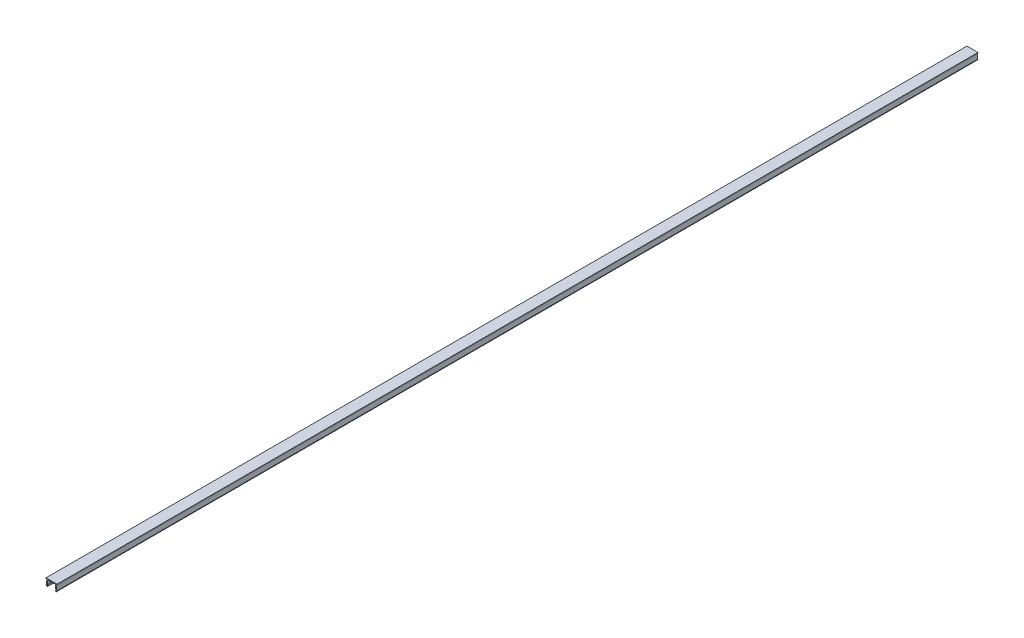
ISO-10303-21;
HEADER;
FILE_DESCRIPTION(('STEP AP214'),'2;1');
FILE_NAME('part.step','',(''),(''),'','','');
FILE_SCHEMA(('AUTOMOTIVE_DESIGN { 1 0 10303 214 1 1 1 1 }'));
ENDSEC;
DATA;
#1=APPLICATION_CONTEXT('core data for automotive mechanical design processes');
#2=APPLICATION_PROTOCOL_DEFINITION('international standard','automotive_design',2000,#1);
#3=PRODUCT_CONTEXT('',#1,'mechanical');
#4=PRODUCT('Part','Part','',(#3));
#5=PRODUCT_RELATED_PRODUCT_CATEGORY('part','',(#4));
#6=PRODUCT_DEFINITION_FORMATION('','',#4);
#7=PRODUCT_DEFINITION_CONTEXT('part definition',#1,'design');
#8=PRODUCT_DEFINITION('design','',#6,#7);
#9=PRODUCT_DEFINITION_SHAPE('','',#8);
#10=(LENGTH_UNIT() NAMED_UNIT(*) SI_UNIT(.MILLI.,.METRE.));
#11=(NAMED_UNIT(*) PLANE_ANGLE_UNIT() SI_UNIT($,.RADIAN.));
#12=(NAMED_UNIT(*) SI_UNIT($,.STERADIAN.) SOLID_ANGLE_UNIT());
#13=UNCERTAINTY_MEASURE_WITH_UNIT(LENGTH_MEASURE(1.E-05),#10,'distance_accuracy_value','');
#14=(GEOMETRIC_REPRESENTATION_CONTEXT(3) GLOBAL_UNCERTAINTY_ASSIGNED_CONTEXT((#13)) GLOBAL_UNIT_ASSIGNED_CONTEXT((#10,
#11,#12)) REPRESENTATION_CONTEXT('',''));
#15=CARTESIAN_POINT('',(0.,0.,0.));
#16=DIRECTION('',(0.,0.,1.));
#17=DIRECTION('',(1.,0.,0.));
#18=AXIS2_PLACEMENT_3D('',#15,#16,#17);
#19=CARTESIAN_POINT('',(-6.,0.5,500.));
#20=DIRECTION('',(1.,0.,0.));
#21=DIRECTION('',(0.,0.,-1.));
#22=AXIS2_PLACEMENT_3D('',#19,#20,#21);
#23=PLANE('',#22);
#24=DIRECTION('',(0.,-1.,0.));
#25=VECTOR('',#24,1.);
#26=CARTESIAN_POINT('',(-6.,0.5,-500.));
#27=LINE('',#26,#25);
#28=CARTESIAN_POINT('',(-6.,0.5,-500.));
#29=VERTEX_POINT('',#28);
#30=CARTESIAN_POINT('',(-6.,-0.5,-500.));
#31=VERTEX_POINT('',#30);
#32=EDGE_CURVE('E160',#29,#31,#27,.T.);
#33=ORIENTED_EDGE('',*,*,#32,.T.);
#34=DIRECTION('',(0.,0.,-1.));
#35=VECTOR('',#34,1.);
#36=CARTESIAN_POINT('',(-6.,-0.5,500.));
#37=LINE('',#36,#35);
#38=CARTESIAN_POINT('',(-6.,-0.5,500.));
#39=VERTEX_POINT('',#38);
#40=EDGE_CURVE('E10',#39,#31,#37,.T.);
#41=ORIENTED_EDGE('',*,*,#40,.F.);
#42=DIRECTION('',(0.,-1.,0.));
#43=VECTOR('',#42,1.);
#44=CARTESIAN_POINT('',(-6.,0.5,500.));
#45=LINE('',#44,#43);
#46=CARTESIAN_POINT('',(-6.,0.5,500.));
#47=VERTEX_POINT('',#46);
#48=EDGE_CURVE('E190',#47,#39,#45,.T.);
#49=ORIENTED_EDGE('',*,*,#48,.F.);
#50=DIRECTION('',(0.,0.,-1.));
#51=VECTOR('',#50,1.);
#52=CARTESIAN_POINT('',(-6.,0.5,500.));
#53=LINE('',#52,#51);
#54=EDGE_CURVE('E156',#47,#29,#53,.T.);
#55=ORIENTED_EDGE('',*,*,#54,.T.);
#56=EDGE_LOOP('',(#33,#41,#49,#55));
#57=FACE_BOUND('',#56,.T.);
#58=ADVANCED_FACE('F16',(#57),#23,.F.);
#59=CARTESIAN_POINT('',(-6.,-0.5,500.));
#60=DIRECTION('',(0.,1.,0.));
#61=DIRECTION('',(0.,0.,1.));
#62=AXIS2_PLACEMENT_3D('',#59,#60,#61);
#63=PLANE('',#62);
#64=DIRECTION('',(1.,0.,0.));
#65=VECTOR('',#64,1.);
#66=CARTESIAN_POINT('',(-6.,-0.5,-500.));
#67=LINE('',#66,#65);
#68=CARTESIAN_POINT('',(-5.,-0.5,-500.));
#69=VERTEX_POINT('',#68);
#70=EDGE_CURVE('E163',#31,#69,#67,.T.);
#71=ORIENTED_EDGE('',*,*,#70,.T.);
#72=DIRECTION('',(0.,0.,-1.));
#73=VECTOR('',#72,1.);
#74=CARTESIAN_POINT('',(-5.,-0.5,500.));
#75=LINE('',#74,#73);
#76=CARTESIAN_POINT('',(-5.,-0.5,500.));
#77=VERTEX_POINT('',#76);
#78=EDGE_CURVE('E24',#77,#69,#75,.T.);
#79=ORIENTED_EDGE('',*,*,#78,.F.);
#80=DIRECTION('',(1.,0.,0.));
#81=VECTOR('',#80,1.);
#82=CARTESIAN_POINT('',(-6.,-0.5,500.));
#83=LINE('',#82,#81);
#84=EDGE_CURVE('E99',#39,#77,#83,.T.);
#85=ORIENTED_EDGE('',*,*,#84,.F.);
#86=ORIENTED_EDGE('',*,*,#40,.T.);
#87=EDGE_LOOP('',(#71,#79,#85,#86));
#88=FACE_BOUND('',#87,.T.);
#89=ADVANCED_FACE('F289',(#88),#63,.F.);
#90=CARTESIAN_POINT('',(-5.,-0.5,500.));
#91=DIRECTION('',(0.990830168044299,-0.135113204733313,0.));
#92=DIRECTION('',(0.135113204733313,0.990830168044299,0.));
#93=AXIS2_PLACEMENT_3D('',#90,#91,#92);
#94=PLANE('',#93);
#95=DIRECTION('',(-0.135113204733313,-0.990830168044299,0.));
#96=VECTOR('',#95,1.);
#97=CARTESIAN_POINT('',(-5.,-0.5,-500.));
#98=LINE('',#97,#96);
#99=CARTESIAN_POINT('',(-5.75,-6.,-500.));
#100=VERTEX_POINT('',#99);
#101=EDGE_CURVE('E165',#69,#100,#98,.T.);
#102=ORIENTED_EDGE('',*,*,#101,.T.);
#103=DIRECTION('',(0.,0.,-1.));
#104=VECTOR('',#103,1.);
#105=CARTESIAN_POINT('',(-5.75,-6.,500.));
#106=LINE('',#105,#104);
#107=CARTESIAN_POINT('',(-5.75,-6.,500.));
#108=VERTEX_POINT('',#107);
#109=EDGE_CURVE('E221',#108,#100,#106,.T.);
#110=ORIENTED_EDGE('',*,*,#109,.F.);
#111=DIRECTION('',(-0.135113204733313,-0.990830168044299,0.));
#112=VECTOR('',#111,1.);
#113=CARTESIAN_POINT('',(-5.,-0.5,500.));
#114=LINE('',#113,#112);
#115=EDGE_CURVE('E229',#77,#108,#114,.T.);
#116=ORIENTED_EDGE('',*,*,#115,.F.);
#117=ORIENTED_EDGE('',*,*,#78,.T.);
#118=EDGE_LOOP('',(#102,#110,#116,#117));
#119=FACE_BOUND('',#118,.T.);
#120=ADVANCED_FACE('F227',(#119),#94,.F.);
#121=CARTESIAN_POINT('',(-5.75,-6.,500.));
#122=DIRECTION('',(0.857492925712544,0.514495755427527,0.));
#123=DIRECTION('',(-0.514495755427527,0.857492925712544,0.));
#124=AXIS2_PLACEMENT_3D('',#121,#122,#123);
#125=PLANE('',#124);
#126=DIRECTION('',(0.514495755427527,-0.857492925712544,0.));
#127=VECTOR('',#126,1.);
#128=CARTESIAN_POINT('',(-5.75,-6.,-500.));
#129=LINE('',#128,#127);
#130=CARTESIAN_POINT('',(-5.,-7.25,-500.));
#131=VERTEX_POINT('',#130);
#132=EDGE_CURVE('E167',#100,#131,#129,.T.);
#133=ORIENTED_EDGE('',*,*,#132,.T.);
#134=DIRECTION('',(0.,0.,-1.));
#135=VECTOR('',#134,1.);
#136=CARTESIAN_POINT('',(-5.,-7.25,500.));
#137=LINE('',#136,#135);
#138=CARTESIAN_POINT('',(-5.,-7.25,500.));
#139=VERTEX_POINT('',#138);
#140=EDGE_CURVE('E218',#139,#131,#137,.T.);
#141=ORIENTED_EDGE('',*,*,#140,.F.);
#142=DIRECTION('',(0.514495755427527,-0.857492925712544,0.));
#143=VECTOR('',#142,1.);
#144=CARTESIAN_POINT('',(-5.75,-6.,500.));
#145=LINE('',#144,#143);
#146=EDGE_CURVE('E247',#108,#139,#145,.T.);
#147=ORIENTED_EDGE('',*,*,#146,.F.);
#148=ORIENTED_EDGE('',*,*,#109,.T.);
#149=EDGE_LOOP('',(#133,#141,#147,#148));
#150=FACE_BOUND('',#149,.T.);
#151=ADVANCED_FACE('F238',(#150),#125,.F.);
#152=CARTESIAN_POINT('',(-5.,-7.25,500.));
#153=DIRECTION('',(-0.514495755427526,0.857492925712545,0.));
#154=DIRECTION('',(-0.857492925712545,-0.514495755427526,0.));
#155=AXIS2_PLACEMENT_3D('',#152,#153,#154);
#156=PLANE('',#155);
#157=DIRECTION('',(0.857492925712545,0.514495755427526,0.));
#158=VECTOR('',#157,1.);
#159=CARTESIAN_POINT('',(-5.,-7.25,-500.));
#160=LINE('',#159,#158);
#161=CARTESIAN_POINT('',(-4.14250707428745,-6.73550424457247,-500.));
#162=VERTEX_POINT('',#161);
#163=EDGE_CURVE('E169',#131,#162,#160,.T.);
#164=ORIENTED_EDGE('',*,*,#163,.T.);
#165=DIRECTION('',(0.,0.,-1.));
#166=VECTOR('',#165,1.);
#167=CARTESIAN_POINT('',(-4.14250707428745,-6.73550424457247,500.));
#168=LINE('',#167,#166);
#169=CARTESIAN_POINT('',(-4.14250707428745,-6.73550424457247,500.));
#170=VERTEX_POINT('',#169);
#171=EDGE_CURVE('E215',#170,#162,#168,.T.);
#172=ORIENTED_EDGE('',*,*,#171,.F.);
#173=DIRECTION('',(0.857492925712545,0.514495755427526,0.));
#174=VECTOR('',#173,1.);
#175=CARTESIAN_POINT('',(-5.,-7.25,500.));
#176=LINE('',#175,#174);
#177=EDGE_CURVE('E244',#139,#170,#176,.T.);
#178=ORIENTED_EDGE('',*,*,#177,.F.);
#179=ORIENTED_EDGE('',*,*,#140,.T.);
#180=EDGE_LOOP('',(#164,#172,#178,#179));
#181=FACE_BOUND('',#180,.T.);
#182=ADVANCED_FACE('F242',(#181),#156,.F.);
#183=CARTESIAN_POINT('',(-4.71168314051778,-5.78687746752192,500.));
#184=DIRECTION('',(-0.857492925712544,-0.514495755427527,0.));
#185=DIRECTION('',(0.514495755427527,-0.857492925712544,0.));
#186=AXIS2_PLACEMENT_3D('',#183,#184,#185);
#187=PLANE('',#186);
#188=DIRECTION('',(-0.514495755427527,0.857492925712544,0.));
#189=VECTOR('',#188,1.);
#190=CARTESIAN_POINT('',(-4.71168314051778,-5.78687746752192,-500.));
#191=LINE('',#190,#189);
#192=CARTESIAN_POINT('',(-4.71168314051778,-5.78687746752192,-500.));
#193=VERTEX_POINT('',#192);
#194=EDGE_CURVE('E171',#162,#193,#191,.T.);
#195=ORIENTED_EDGE('',*,*,#194,.T.);
#196=DIRECTION('',(0.,0.,-1.));
#197=VECTOR('',#196,1.);
#198=CARTESIAN_POINT('',(-4.71168314051778,-5.78687746752192,500.));
#199=LINE('',#198,#197);
#200=CARTESIAN_POINT('',(-4.71168314051778,-5.78687746752192,500.));
#201=VERTEX_POINT('',#200);
#202=EDGE_CURVE('E212',#201,#193,#199,.T.);
#203=ORIENTED_EDGE('',*,*,#202,.F.);
#204=DIRECTION('',(-0.514495755427527,0.857492925712544,0.));
#205=VECTOR('',#204,1.);
#206=CARTESIAN_POINT('',(-4.71168314051778,-5.78687746752192,500.));
#207=LINE('',#206,#205);
#208=EDGE_CURVE('E246',#170,#201,#207,.T.);
#209=ORIENTED_EDGE('',*,*,#208,.F.);
#210=ORIENTED_EDGE('',*,*,#171,.T.);
#211=EDGE_LOOP('',(#195,#203,#209,#210));
#212=FACE_BOUND('',#211,.T.);
#213=ADVANCED_FACE('F302',(#212),#187,.F.);
#214=CARTESIAN_POINT('',(-3.99074530403752,-0.5,500.));
#215=DIRECTION('',(-0.990830168044299,0.135113204733313,0.));
#216=DIRECTION('',(-0.135113204733313,-0.990830168044299,0.));
#217=AXIS2_PLACEMENT_3D('',#214,#215,#216);
#218=PLANE('',#217);
#219=DIRECTION('',(0.135113204733313,0.990830168044299,0.));
#220=VECTOR('',#219,1.);
#221=CARTESIAN_POINT('',(-3.99074530403752,-0.5,-500.));
#222=LINE('',#221,#220);
#223=CARTESIAN_POINT('',(-3.99074530403752,-0.5,-500.));
#224=VERTEX_POINT('',#223);
#225=EDGE_CURVE('E173',#193,#224,#222,.T.);
#226=ORIENTED_EDGE('',*,*,#225,.T.);
#227=DIRECTION('',(0.,0.,-1.));
#228=VECTOR('',#227,1.);
#229=CARTESIAN_POINT('',(-3.99074530403752,-0.5,500.));
#230=LINE('',#229,#228);
#231=CARTESIAN_POINT('',(-3.99074530403752,-0.5,500.));
#232=VERTEX_POINT('',#231);
#233=EDGE_CURVE('E209',#232,#224,#230,.T.);
#234=ORIENTED_EDGE('',*,*,#233,.F.);
#235=DIRECTION('',(0.135113204733313,0.990830168044299,0.));
#236=VECTOR('',#235,1.);
#237=CARTESIAN_POINT('',(-3.99074530403752,-0.5,500.));
#238=LINE('',#237,#236);
#239=EDGE_CURVE('E249',#201,#232,#238,.T.);
#240=ORIENTED_EDGE('',*,*,#239,.F.);
#241=ORIENTED_EDGE('',*,*,#202,.T.);
#242=EDGE_LOOP('',(#226,#234,#240,#241));
#243=FACE_BOUND('',#242,.T.);
#244=ADVANCED_FACE('F305',(#243),#218,.F.);
#245=CARTESIAN_POINT('',(-3.99074530403752,-0.5,500.));
#246=DIRECTION('',(0.,1.,0.));
#247=DIRECTION('',(0.,0.,1.));
#248=AXIS2_PLACEMENT_3D('',#245,#246,#247);
#249=PLANE('',#248);
#250=DIRECTION('',(1.,0.,0.));
#251=VECTOR('',#250,1.);
#252=CARTESIAN_POINT('',(-3.99074530403752,-0.5,-500.));
#253=LINE('',#252,#251);
#254=CARTESIAN_POINT('',(3.99074530403752,-0.5,-500.));
#255=VERTEX_POINT('',#254);
#256=EDGE_CURVE('E175',#224,#255,#253,.T.);
#257=ORIENTED_EDGE('',*,*,#256,.T.);
#258=DIRECTION('',(0.,0.,-1.));
#259=VECTOR('',#258,1.);
#260=CARTESIAN_POINT('',(3.99074530403752,-0.5,500.));
#261=LINE('',#260,#259);
#262=CARTESIAN_POINT('',(3.99074530403752,-0.5,500.));
#263=VERTEX_POINT('',#262);
#264=EDGE_CURVE('E206',#263,#255,#261,.T.);
#265=ORIENTED_EDGE('',*,*,#264,.F.);
#266=DIRECTION('',(1.,0.,0.));
#267=VECTOR('',#266,1.);
#268=CARTESIAN_POINT('',(-3.99074530403752,-0.5,500.));
#269=LINE('',#268,#267);
#270=EDGE_CURVE('E255',#232,#263,#269,.T.);
#271=ORIENTED_EDGE('',*,*,#270,.F.);
#272=ORIENTED_EDGE('',*,*,#233,.T.);
#273=EDGE_LOOP('',(#257,#265,#271,#272));
#274=FACE_BOUND('',#273,.T.);
#275=ADVANCED_FACE('F309',(#274),#249,.F.);
#276=CARTESIAN_POINT('',(3.99074530403752,-0.5,500.));
#277=DIRECTION('',(0.990830168044299,0.135113204733313,0.));
#278=DIRECTION('',(-0.135113204733313,0.990830168044299,0.));
#279=AXIS2_PLACEMENT_3D('',#276,#277,#278);
#280=PLANE('',#279);
#281=DIRECTION('',(0.135113204733313,-0.990830168044299,0.));
#282=VECTOR('',#281,1.);
#283=CARTESIAN_POINT('',(3.99074530403752,-0.5,-500.));
#284=LINE('',#283,#282);
#285=CARTESIAN_POINT('',(4.71168314051778,-5.78687746752192,-500.));
#286=VERTEX_POINT('',#285);
#287=EDGE_CURVE('E177',#255,#286,#284,.T.);
#288=ORIENTED_EDGE('',*,*,#287,.T.);
#289=DIRECTION('',(0.,0.,-1.));
#290=VECTOR('',#289,1.);
#291=CARTESIAN_POINT('',(4.71168314051778,-5.78687746752192,500.));
#292=LINE('',#291,#290);
#293=CARTESIAN_POINT('',(4.71168314051778,-5.78687746752192,500.));
#294=VERTEX_POINT('',#293);
#295=EDGE_CURVE('E203',#294,#286,#292,.T.);
#296=ORIENTED_EDGE('',*,*,#295,.F.);
#297=DIRECTION('',(0.135113204733313,-0.990830168044299,0.));
#298=VECTOR('',#297,1.);
#299=CARTESIAN_POINT('',(3.99074530403752,-0.5,500.));
#300=LINE('',#299,#298);
#301=EDGE_CURVE('E257',#263,#294,#300,.T.);
#302=ORIENTED_EDGE('',*,*,#301,.F.);
#303=ORIENTED_EDGE('',*,*,#264,.T.);
#304=EDGE_LOOP('',(#288,#296,#302,#303));
#305=FACE_BOUND('',#304,.T.);
#306=ADVANCED_FACE('F313',(#305),#280,.F.);
#307=CARTESIAN_POINT('',(4.71168314051778,-5.78687746752192,500.));
#308=DIRECTION('',(0.857492925712544,-0.514495755427527,0.));
#309=DIRECTION('',(0.514495755427527,0.857492925712544,0.));
#310=AXIS2_PLACEMENT_3D('',#307,#308,#309);
#311=PLANE('',#310);
#312=DIRECTION('',(-0.514495755427527,-0.857492925712544,0.));
#313=VECTOR('',#312,1.);
#314=CARTESIAN_POINT('',(4.71168314051778,-5.78687746752192,-500.));
#315=LINE('',#314,#313);
#316=CARTESIAN_POINT('',(4.14250707428745,-6.73550424457247,-500.));
#317=VERTEX_POINT('',#316);
#318=EDGE_CURVE('E179',#286,#317,#315,.T.);
#319=ORIENTED_EDGE('',*,*,#318,.T.);
#320=DIRECTION('',(0.,0.,-1.));
#321=VECTOR('',#320,1.);
#322=CARTESIAN_POINT('',(4.14250707428745,-6.73550424457247,500.));
#323=LINE('',#322,#321);
#324=CARTESIAN_POINT('',(4.14250707428745,-6.73550424457247,500.));
#325=VERTEX_POINT('',#324);
#326=EDGE_CURVE('E200',#325,#317,#323,.T.);
#327=ORIENTED_EDGE('',*,*,#326,.F.);
#328=DIRECTION('',(-0.514495755427527,-0.857492925712544,0.));
#329=VECTOR('',#328,1.);
#330=CARTESIAN_POINT('',(4.71168314051778,-5.78687746752192,500.));
#331=LINE('',#330,#329);
#332=EDGE_CURVE('E259',#294,#325,#331,.T.);
#333=ORIENTED_EDGE('',*,*,#332,.F.);
#334=ORIENTED_EDGE('',*,*,#295,.T.);
#335=EDGE_LOOP('',(#319,#327,#333,#334));
#336=FACE_BOUND('',#335,.T.);
#337=ADVANCED_FACE('F317',(#336),#311,.F.);
#338=CARTESIAN_POINT('',(5.,-7.25,500.));
#339=DIRECTION('',(0.514495755427526,0.857492925712545,0.));
#340=DIRECTION('',(-0.857492925712545,0.514495755427526,0.));
#341=AXIS2_PLACEMENT_3D('',#338,#339,#340);
#342=PLANE('',#341);
#343=DIRECTION('',(0.857492925712545,-0.514495755427526,0.));
#344=VECTOR('',#343,1.);
#345=CARTESIAN_POINT('',(5.,-7.25,-500.));
#346=LINE('',#345,#344);
#347=CARTESIAN_POINT('',(5.,-7.25,-500.));
#348=VERTEX_POINT('',#347);
#349=EDGE_CURVE('E181',#317,#348,#346,.T.);
#350=ORIENTED_EDGE('',*,*,#349,.T.);
#351=DIRECTION('',(0.,0.,-1.));
#352=VECTOR('',#351,1.);
#353=CARTESIAN_POINT('',(5.,-7.25,500.));
#354=LINE('',#353,#352);
#355=CARTESIAN_POINT('',(5.,-7.25,500.));
#356=VERTEX_POINT('',#355);
#357=EDGE_CURVE('E197',#356,#348,#354,.T.);
#358=ORIENTED_EDGE('',*,*,#357,.F.);
#359=DIRECTION('',(0.857492925712545,-0.514495755427526,0.));
#360=VECTOR('',#359,1.);
#361=CARTESIAN_POINT('',(5.,-7.25,500.));
#362=LINE('',#361,#360);
#363=EDGE_CURVE('E261',#325,#356,#362,.T.);
#364=ORIENTED_EDGE('',*,*,#363,.F.);
#365=ORIENTED_EDGE('',*,*,#326,.T.);
#366=EDGE_LOOP('',(#350,#358,#364,#365));
#367=FACE_BOUND('',#366,.T.);
#368=ADVANCED_FACE('F321',(#367),#342,.F.);
#369=CARTESIAN_POINT('',(5.75,-6.,500.));
#370=DIRECTION('',(-0.857492925712544,0.514495755427527,0.));
#371=DIRECTION('',(-0.514495755427527,-0.857492925712544,0.));
#372=AXIS2_PLACEMENT_3D('',#369,#370,#371);
#373=PLANE('',#372);
#374=DIRECTION('',(0.514495755427527,0.857492925712544,0.));
#375=VECTOR('',#374,1.);
#376=CARTESIAN_POINT('',(5.75,-6.,-500.));
#377=LINE('',#376,#375);
#378=CARTESIAN_POINT('',(5.75,-6.,-500.));
#379=VERTEX_POINT('',#378);
#380=EDGE_CURVE('E183',#348,#379,#377,.T.);
#381=ORIENTED_EDGE('',*,*,#380,.T.);
#382=DIRECTION('',(0.,0.,-1.));
#383=VECTOR('',#382,1.);
#384=CARTESIAN_POINT('',(5.75,-6.,500.));
#385=LINE('',#384,#383);
#386=CARTESIAN_POINT('',(5.75,-6.,500.));
#387=VERTEX_POINT('',#386);
#388=EDGE_CURVE('E194',#387,#379,#385,.T.);
#389=ORIENTED_EDGE('',*,*,#388,.F.);
#390=DIRECTION('',(0.514495755427527,0.857492925712544,0.));
#391=VECTOR('',#390,1.);
#392=CARTESIAN_POINT('',(5.75,-6.,500.));
#393=LINE('',#392,#391);
#394=EDGE_CURVE('E263',#356,#387,#393,.T.);
#395=ORIENTED_EDGE('',*,*,#394,.F.);
#396=ORIENTED_EDGE('',*,*,#357,.T.);
#397=EDGE_LOOP('',(#381,#389,#395,#396));
#398=FACE_BOUND('',#397,.T.);
#399=ADVANCED_FACE('F269',(#398),#373,.F.);
#400=CARTESIAN_POINT('',(5.,-0.5,500.));
#401=DIRECTION('',(-0.990830168044299,-0.135113204733313,0.));
#402=DIRECTION('',(0.135113204733313,-0.990830168044299,0.));
#403=AXIS2_PLACEMENT_3D('',#400,#401,#402);
#404=PLANE('',#403);
#405=DIRECTION('',(-0.135113204733313,0.990830168044299,0.));
#406=VECTOR('',#405,1.);
#407=CARTESIAN_POINT('',(5.,-0.5,-500.));
#408=LINE('',#407,#406);
#409=CARTESIAN_POINT('',(5.,-0.5,-500.));
#410=VERTEX_POINT('',#409);
#411=EDGE_CURVE('E185',#379,#410,#408,.T.);
#412=ORIENTED_EDGE('',*,*,#411,.T.);
#413=DIRECTION('',(0.,0.,-1.));
#414=VECTOR('',#413,1.);
#415=CARTESIAN_POINT('',(5.,-0.5,500.));
#416=LINE('',#415,#414);
#417=CARTESIAN_POINT('',(5.,-0.5,500.));
#418=VERTEX_POINT('',#417);
#419=EDGE_CURVE('E151',#418,#410,#416,.T.);
#420=ORIENTED_EDGE('',*,*,#419,.F.);
#421=DIRECTION('',(-0.135113204733313,0.990830168044299,0.));
#422=VECTOR('',#421,1.);
#423=CARTESIAN_POINT('',(5.,-0.5,500.));
#424=LINE('',#423,#422);
#425=EDGE_CURVE('E142',#387,#418,#424,.T.);
#426=ORIENTED_EDGE('',*,*,#425,.F.);
#427=ORIENTED_EDGE('',*,*,#388,.T.);
#428=EDGE_LOOP('',(#412,#420,#426,#427));
#429=FACE_BOUND('',#428,.T.);
#430=ADVANCED_FACE('F273',(#429),#404,.F.);
#431=CARTESIAN_POINT('',(5.,-0.5,500.));
#432=DIRECTION('',(0.,1.,0.));
#433=DIRECTION('',(0.,0.,1.));
#434=AXIS2_PLACEMENT_3D('',#431,#432,#433);
#435=PLANE('',#434);
#436=DIRECTION('',(1.,0.,0.));
#437=VECTOR('',#436,1.);
#438=CARTESIAN_POINT('',(5.,-0.5,-500.));
#439=LINE('',#438,#437);
#440=CARTESIAN_POINT('',(6.,-0.5,-500.));
#441=VERTEX_POINT('',#440);
#442=EDGE_CURVE('E150',#410,#441,#439,.T.);
#443=ORIENTED_EDGE('',*,*,#442,.T.);
#444=DIRECTION('',(0.,0.,-1.));
#445=VECTOR('',#444,1.);
#446=CARTESIAN_POINT('',(6.,-0.5,500.));
#447=LINE('',#446,#445);
#448=CARTESIAN_POINT('',(6.,-0.5,500.));
#449=VERTEX_POINT('',#448);
#450=EDGE_CURVE('E147',#449,#441,#447,.T.);
#451=ORIENTED_EDGE('',*,*,#450,.F.);
#452=DIRECTION('',(1.,0.,0.));
#453=VECTOR('',#452,1.);
#454=CARTESIAN_POINT('',(5.,-0.5,500.));
#455=LINE('',#454,#453);
#456=EDGE_CURVE('E136',#418,#449,#455,.T.);
#457=ORIENTED_EDGE('',*,*,#456,.F.);
#458=ORIENTED_EDGE('',*,*,#419,.T.);
#459=EDGE_LOOP('',(#443,#451,#457,#458));
#460=FACE_BOUND('',#459,.T.);
#461=ADVANCED_FACE('F148',(#460),#435,.F.);
#462=CARTESIAN_POINT('',(6.,0.5,500.));
#463=DIRECTION('',(-1.,0.,0.));
#464=DIRECTION('',(0.,0.,1.));
#465=AXIS2_PLACEMENT_3D('',#462,#463,#464);
#466=PLANE('',#465);
#467=DIRECTION('',(0.,1.,0.));
#468=VECTOR('',#467,1.);
#469=CARTESIAN_POINT('',(6.,0.5,-500.));
#470=LINE('',#469,#468);
#471=CARTESIAN_POINT('',(6.,0.5,-500.));
#472=VERTEX_POINT('',#471);
#473=EDGE_CURVE('E85',#441,#472,#470,.T.);
#474=ORIENTED_EDGE('',*,*,#473,.T.);
#475=DIRECTION('',(0.,0.,-1.));
#476=VECTOR('',#475,1.);
#477=CARTESIAN_POINT('',(6.,0.5,500.));
#478=LINE('',#477,#476);
#479=CARTESIAN_POINT('',(6.,0.5,500.));
#480=VERTEX_POINT('',#479);
#481=EDGE_CURVE('E152',#480,#472,#478,.T.);
#482=ORIENTED_EDGE('',*,*,#481,.F.);
#483=DIRECTION('',(0.,1.,0.));
#484=VECTOR('',#483,1.);
#485=CARTESIAN_POINT('',(6.,0.5,500.));
#486=LINE('',#485,#484);
#487=EDGE_CURVE('E140',#449,#480,#486,.T.);
#488=ORIENTED_EDGE('',*,*,#487,.F.);
#489=ORIENTED_EDGE('',*,*,#450,.T.);
#490=EDGE_LOOP('',(#474,#482,#488,#489));
#491=FACE_BOUND('',#490,.T.);
#492=ADVANCED_FACE('F154',(#491),#466,.F.);
#493=CARTESIAN_POINT('',(-6.,0.5,500.));
#494=DIRECTION('',(0.,-1.,0.));
#495=DIRECTION('',(0.,0.,-1.));
#496=AXIS2_PLACEMENT_3D('',#493,#494,#495);
#497=PLANE('',#496);
#498=DIRECTION('',(-1.,0.,0.));
#499=VECTOR('',#498,1.);
#500=CARTESIAN_POINT('',(-6.,0.5,-500.));
#501=LINE('',#500,#499);
#502=EDGE_CURVE('E91',#472,#29,#501,.T.);
#503=ORIENTED_EDGE('',*,*,#502,.T.);
#504=ORIENTED_EDGE('',*,*,#54,.F.);
#505=DIRECTION('',(-1.,0.,0.));
#506=VECTOR('',#505,1.);
#507=CARTESIAN_POINT('',(-6.,0.5,500.));
#508=LINE('',#507,#506);
#509=EDGE_CURVE('E32',#480,#47,#508,.T.);
#510=ORIENTED_EDGE('',*,*,#509,.F.);
#511=ORIENTED_EDGE('',*,*,#481,.T.);
#512=EDGE_LOOP('',(#503,#504,#510,#511));
#513=FACE_BOUND('',#512,.T.);
#514=ADVANCED_FACE('F277',(#513),#497,.F.);
#515=CARTESIAN_POINT('',(0.,0.,500.));
#516=DIRECTION('',(0.,0.,1.));
#517=DIRECTION('',(1.,0.,0.));
#518=AXIS2_PLACEMENT_3D('',#515,#516,#517);
#519=PLANE('',#518);
#520=ORIENTED_EDGE('',*,*,#48,.T.);
#521=ORIENTED_EDGE('',*,*,#84,.T.);
#522=ORIENTED_EDGE('',*,*,#115,.T.);
#523=ORIENTED_EDGE('',*,*,#146,.T.);
#524=ORIENTED_EDGE('',*,*,#177,.T.);
#525=ORIENTED_EDGE('',*,*,#208,.T.);
#526=ORIENTED_EDGE('',*,*,#239,.T.);
#527=ORIENTED_EDGE('',*,*,#270,.T.);
#528=ORIENTED_EDGE('',*,*,#301,.T.);
#529=ORIENTED_EDGE('',*,*,#332,.T.);
#530=ORIENTED_EDGE('',*,*,#363,.T.);
#531=ORIENTED_EDGE('',*,*,#394,.T.);
#532=ORIENTED_EDGE('',*,*,#425,.T.);
#533=ORIENTED_EDGE('',*,*,#456,.T.);
#534=ORIENTED_EDGE('',*,*,#487,.T.);
#535=ORIENTED_EDGE('',*,*,#509,.T.);
#536=EDGE_LOOP('',(#520,#521,#522,#523,#524,#525,#526,#527,#528,#529,#530,#531,#532,#533,#534,#535));
#537=FACE_BOUND('',#536,.T.);
#538=ADVANCED_FACE('F138',(#537),#519,.T.);
#539=CARTESIAN_POINT('',(0.,0.,-500.));
#540=DIRECTION('',(0.,0.,1.));
#541=DIRECTION('',(1.,0.,0.));
#542=AXIS2_PLACEMENT_3D('',#539,#540,#541);
#543=PLANE('',#542);
#544=ORIENTED_EDGE('',*,*,#32,.F.);
#545=ORIENTED_EDGE('',*,*,#502,.F.);
#546=ORIENTED_EDGE('',*,*,#473,.F.);
#547=ORIENTED_EDGE('',*,*,#442,.F.);
#548=ORIENTED_EDGE('',*,*,#411,.F.);
#549=ORIENTED_EDGE('',*,*,#380,.F.);
#550=ORIENTED_EDGE('',*,*,#349,.F.);
#551=ORIENTED_EDGE('',*,*,#318,.F.);
#552=ORIENTED_EDGE('',*,*,#287,.F.);
#553=ORIENTED_EDGE('',*,*,#256,.F.);
#554=ORIENTED_EDGE('',*,*,#225,.F.);
#555=ORIENTED_EDGE('',*,*,#194,.F.);
#556=ORIENTED_EDGE('',*,*,#163,.F.);
#557=ORIENTED_EDGE('',*,*,#132,.F.);
#558=ORIENTED_EDGE('',*,*,#101,.F.);
#559=ORIENTED_EDGE('',*,*,#70,.F.);
#560=EDGE_LOOP('',(#544,#545,#546,#547,#548,#549,#550,#551,#552,#553,#554,#555,#556,#557,#558,#559));
#561=FACE_BOUND('',#560,.T.);
#562=ADVANCED_FACE('F233',(#561),#543,.F.);
#563=CLOSED_SHELL('',(#58,#89,#120,#151,#182,#213,#244,#275,#306,#337,#368,#399,#430,#461,#492,
#514,#538,#562));
#564=MANIFOLD_SOLID_BREP('B1',#563);
#565=ADVANCED_BREP_SHAPE_REPRESENTATION('',(#18,#564),#14);
#566=SHAPE_DEFINITION_REPRESENTATION(#9,#565);
ENDSEC;
END-ISO-10303-21;
